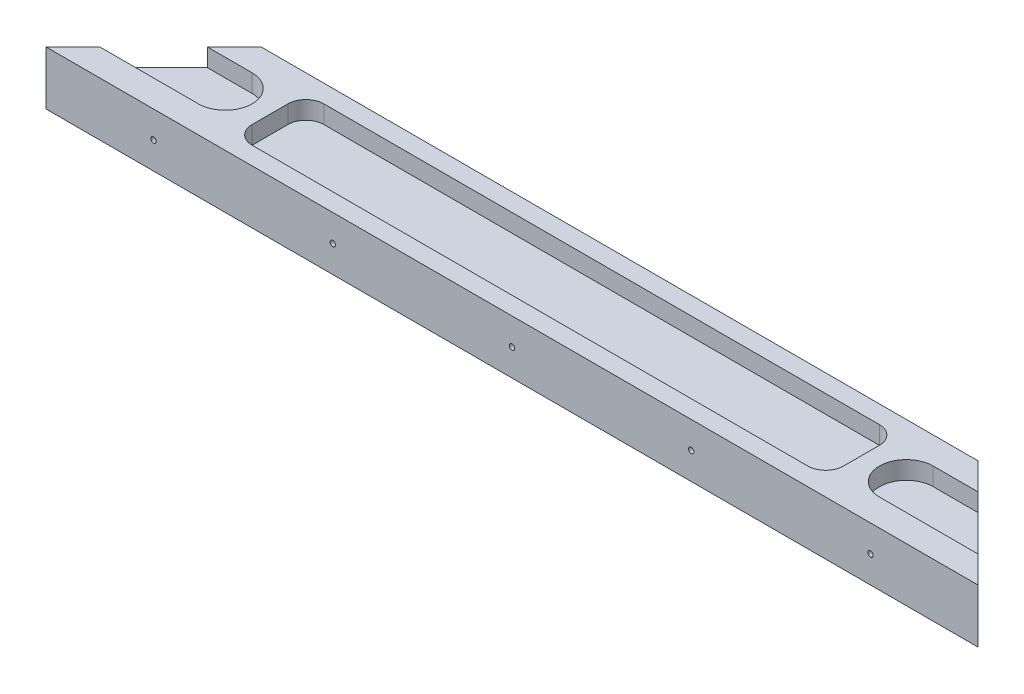
ISO-10303-21;
HEADER;
FILE_DESCRIPTION(('STEP AP214'),'2;1');
FILE_NAME('part.step','',(''),(''),'','','');
FILE_SCHEMA(('AUTOMOTIVE_DESIGN { 1 0 10303 214 1 1 1 1 }'));
ENDSEC;
DATA;
#1=APPLICATION_CONTEXT('core data for automotive mechanical design processes');
#2=APPLICATION_PROTOCOL_DEFINITION('international standard','automotive_design',2000,#1);
#3=PRODUCT_CONTEXT('',#1,'mechanical');
#4=PRODUCT('Part','Part','',(#3));
#5=PRODUCT_RELATED_PRODUCT_CATEGORY('part','',(#4));
#6=PRODUCT_DEFINITION_FORMATION('','',#4);
#7=PRODUCT_DEFINITION_CONTEXT('part definition',#1,'design');
#8=PRODUCT_DEFINITION('design','',#6,#7);
#9=PRODUCT_DEFINITION_SHAPE('','',#8);
#10=(LENGTH_UNIT() NAMED_UNIT(*) SI_UNIT(.MILLI.,.METRE.));
#11=(NAMED_UNIT(*) PLANE_ANGLE_UNIT() SI_UNIT($,.RADIAN.));
#12=(NAMED_UNIT(*) SI_UNIT($,.STERADIAN.) SOLID_ANGLE_UNIT());
#13=UNCERTAINTY_MEASURE_WITH_UNIT(LENGTH_MEASURE(1.E-05),#10,'distance_accuracy_value','');
#14=(GEOMETRIC_REPRESENTATION_CONTEXT(3) GLOBAL_UNCERTAINTY_ASSIGNED_CONTEXT((#13)) GLOBAL_UNIT_ASSIGNED_CONTEXT((#10,
#11,#12)) REPRESENTATION_CONTEXT('',''));
#15=CARTESIAN_POINT('',(0.,0.,0.));
#16=DIRECTION('',(0.,0.,1.));
#17=DIRECTION('',(1.,0.,0.));
#18=AXIS2_PLACEMENT_3D('',#15,#16,#17);
#19=CARTESIAN_POINT('',(30.,15.,-30.));
#20=DIRECTION('',(0.707106781186547,0.,0.707106781186548));
#21=DIRECTION('',(0.707106781186548,0.,-0.707106781186547));
#22=AXIS2_PLACEMENT_3D('',#19,#20,#21);
#23=PLANE('',#22);
#24=DIRECTION('',(0.,-1.,0.));
#25=VECTOR('',#24,1.);
#26=CARTESIAN_POINT('',(30.,15.,-30.));
#27=LINE('',#26,#25);
#28=CARTESIAN_POINT('',(30.,15.,-30.));
#29=VERTEX_POINT('',#28);
#30=CARTESIAN_POINT('',(30.,8.24999999999931,-30.));
#31=VERTEX_POINT('',#30);
#32=EDGE_CURVE('E360',#29,#31,#27,.T.);
#33=ORIENTED_EDGE('',*,*,#32,.T.);
#34=CARTESIAN_POINT('',(30.,7.4999999999993,-30.));
#35=DIRECTION('',(0.707106781186547,0.,0.707106781186548));
#36=DIRECTION('',(-0.707106781186548,0.,0.707106781186547));
#37=AXIS2_PLACEMENT_3D('',#34,#35,#36);
#38=ELLIPSE('',#37,1.06066017177984,0.750000000000012);
#39=CARTESIAN_POINT('',(30.,6.74999999999929,-30.));
#40=VERTEX_POINT('',#39);
#41=EDGE_CURVE('E285',#31,#40,#38,.T.);
#42=ORIENTED_EDGE('',*,*,#41,.T.);
#43=CARTESIAN_POINT('',(30.,0.,-30.));
#44=VERTEX_POINT('',#43);
#45=EDGE_CURVE('E349',#40,#44,#27,.T.);
#46=ORIENTED_EDGE('',*,*,#45,.T.);
#47=DIRECTION('',(-0.707106781186548,0.,0.707106781186547));
#48=VECTOR('',#47,1.);
#49=CARTESIAN_POINT('',(30.,0.,-30.));
#50=LINE('',#49,#48);
#51=CARTESIAN_POINT('',(0.,0.,0.));
#52=VERTEX_POINT('',#51);
#53=EDGE_CURVE('E336',#44,#52,#50,.T.);
#54=ORIENTED_EDGE('',*,*,#53,.T.);
#55=DIRECTION('',(0.,-1.,0.));
#56=VECTOR('',#55,1.);
#57=CARTESIAN_POINT('',(0.,15.,0.));
#58=LINE('',#57,#56);
#59=CARTESIAN_POINT('',(0.,15.,0.));
#60=VERTEX_POINT('',#59);
#61=EDGE_CURVE('E370',#60,#52,#58,.T.);
#62=ORIENTED_EDGE('',*,*,#61,.F.);
#63=DIRECTION('',(-0.707106781186548,0.,0.707106781186547));
#64=VECTOR('',#63,1.);
#65=CARTESIAN_POINT('',(30.,15.,-30.));
#66=LINE('',#65,#64);
#67=CARTESIAN_POINT('',(7.49999999999999,15.,-7.49999999999998));
#68=VERTEX_POINT('',#67);
#69=EDGE_CURVE('E341',#68,#60,#66,.T.);
#70=ORIENTED_EDGE('',*,*,#69,.F.);
#71=DIRECTION('',(0.,-1.,0.));
#72=VECTOR('',#71,1.);
#73=CARTESIAN_POINT('',(7.5,15.,-7.49999999999999));
#74=LINE('',#73,#72);
#75=CARTESIAN_POINT('',(7.49999999999998,10.,-7.49999999999998));
#76=VERTEX_POINT('',#75);
#77=EDGE_CURVE('E330',#68,#76,#74,.T.);
#78=ORIENTED_EDGE('',*,*,#77,.T.);
#79=DIRECTION('',(-0.707106781186548,0.,0.707106781186547));
#80=VECTOR('',#79,1.);
#81=CARTESIAN_POINT('',(30.,10.,-30.));
#82=LINE('',#81,#80);
#83=CARTESIAN_POINT('',(22.5,10.,-22.5));
#84=VERTEX_POINT('',#83);
#85=EDGE_CURVE('E47',#84,#76,#82,.T.);
#86=ORIENTED_EDGE('',*,*,#85,.F.);
#87=DIRECTION('',(0.,1.,0.));
#88=VECTOR('',#87,1.);
#89=CARTESIAN_POINT('',(22.5,15.,-22.5));
#90=LINE('',#89,#88);
#91=CARTESIAN_POINT('',(22.5,15.,-22.5));
#92=VERTEX_POINT('',#91);
#93=EDGE_CURVE('E333',#84,#92,#90,.T.);
#94=ORIENTED_EDGE('',*,*,#93,.T.);
#95=EDGE_CURVE('E337',#29,#92,#66,.T.);
#96=ORIENTED_EDGE('',*,*,#95,.F.);
#97=EDGE_LOOP('',(#33,#42,#46,#54,#62,#70,#78,#86,#94,#96));
#98=FACE_BOUND('',#97,.T.);
#99=ADVANCED_FACE('F40',(#98),#23,.F.);
#100=CARTESIAN_POINT('',(0.,15.,0.));
#101=DIRECTION('',(0.,0.,-1.));
#102=DIRECTION('',(-1.,0.,0.));
#103=AXIS2_PLACEMENT_3D('',#100,#101,#102);
#104=PLANE('',#103);
#105=CARTESIAN_POINT('',(30.,7.4999999999993,0.));
#106=DIRECTION('',(0.,0.,1.));
#107=DIRECTION('',(1.,0.,0.));
#108=AXIS2_PLACEMENT_3D('',#105,#106,#107);
#109=CIRCLE('',#108,0.750000000000012);
#110=CARTESIAN_POINT('',(30.75,7.4999999999993,0.));
#111=VERTEX_POINT('',#110);
#112=EDGE_CURVE('E247',#111,#111,#109,.T.);
#113=ORIENTED_EDGE('',*,*,#112,.F.);
#114=EDGE_LOOP('',(#113));
#115=FACE_BOUND('',#114,.T.);
#116=CARTESIAN_POINT('',(80.,7.49999999999965,0.));
#117=DIRECTION('',(0.,0.,1.));
#118=DIRECTION('',(1.,0.,0.));
#119=AXIS2_PLACEMENT_3D('',#116,#117,#118);
#120=CIRCLE('',#119,0.750000000000012);
#121=CARTESIAN_POINT('',(80.75,7.49999999999965,0.));
#122=VERTEX_POINT('',#121);
#123=EDGE_CURVE('E269',#122,#122,#120,.T.);
#124=ORIENTED_EDGE('',*,*,#123,.F.);
#125=EDGE_LOOP('',(#124));
#126=FACE_BOUND('',#125,.T.);
#127=CARTESIAN_POINT('',(230.,7.5,0.));
#128=DIRECTION('',(0.,0.,1.));
#129=DIRECTION('',(1.,0.,0.));
#130=AXIS2_PLACEMENT_3D('',#127,#128,#129);
#131=CIRCLE('',#130,0.750000000000012);
#132=CARTESIAN_POINT('',(230.75,7.5,0.));
#133=VERTEX_POINT('',#132);
#134=EDGE_CURVE('E263',#133,#133,#131,.T.);
#135=ORIENTED_EDGE('',*,*,#134,.F.);
#136=EDGE_LOOP('',(#135));
#137=FACE_BOUND('',#136,.T.);
#138=CARTESIAN_POINT('',(180.,7.5,0.));
#139=DIRECTION('',(0.,0.,1.));
#140=DIRECTION('',(1.,0.,0.));
#141=AXIS2_PLACEMENT_3D('',#138,#139,#140);
#142=CIRCLE('',#141,0.750000000000039);
#143=CARTESIAN_POINT('',(180.75,7.5,0.));
#144=VERTEX_POINT('',#143);
#145=EDGE_CURVE('E262',#144,#144,#142,.T.);
#146=ORIENTED_EDGE('',*,*,#145,.F.);
#147=EDGE_LOOP('',(#146));
#148=FACE_BOUND('',#147,.T.);
#149=CARTESIAN_POINT('',(130.,7.5,0.));
#150=DIRECTION('',(0.,0.,1.));
#151=DIRECTION('',(1.,0.,0.));
#152=AXIS2_PLACEMENT_3D('',#149,#150,#151);
#153=CIRCLE('',#152,0.750000000000012);
#154=CARTESIAN_POINT('',(130.75,7.5,0.));
#155=VERTEX_POINT('',#154);
#156=EDGE_CURVE('E266',#155,#155,#153,.T.);
#157=ORIENTED_EDGE('',*,*,#156,.F.);
#158=EDGE_LOOP('',(#157));
#159=FACE_BOUND('',#158,.T.);
#160=DIRECTION('',(1.,0.,0.));
#161=VECTOR('',#160,1.);
#162=CARTESIAN_POINT('',(0.,0.,0.));
#163=LINE('',#162,#161);
#164=CARTESIAN_POINT('',(260.,0.,0.));
#165=VERTEX_POINT('',#164);
#166=EDGE_CURVE('E352',#52,#165,#163,.T.);
#167=ORIENTED_EDGE('',*,*,#166,.T.);
#168=DIRECTION('',(0.,-1.,0.));
#169=VECTOR('',#168,1.);
#170=CARTESIAN_POINT('',(260.,15.,0.));
#171=LINE('',#170,#169);
#172=CARTESIAN_POINT('',(260.,15.,0.));
#173=VERTEX_POINT('',#172);
#174=EDGE_CURVE('E367',#173,#165,#171,.T.);
#175=ORIENTED_EDGE('',*,*,#174,.F.);
#176=DIRECTION('',(1.,0.,0.));
#177=VECTOR('',#176,1.);
#178=CARTESIAN_POINT('',(0.,15.,0.));
#179=LINE('',#178,#177);
#180=EDGE_CURVE('E340',#60,#173,#179,.T.);
#181=ORIENTED_EDGE('',*,*,#180,.F.);
#182=ORIENTED_EDGE('',*,*,#61,.T.);
#183=EDGE_LOOP('',(#167,#175,#181,#182));
#184=FACE_BOUND('',#183,.T.);
#185=ADVANCED_FACE('F399',(#115,#126,#137,#148,#159,#184),#104,.F.);
#186=CARTESIAN_POINT('',(260.,15.,0.));
#187=DIRECTION('',(-0.707106781186547,0.,0.707106781186548));
#188=DIRECTION('',(0.707106781186548,0.,0.707106781186547));
#189=AXIS2_PLACEMENT_3D('',#186,#187,#188);
#190=PLANE('',#189);
#191=DIRECTION('',(0.,-1.,0.));
#192=VECTOR('',#191,1.);
#193=CARTESIAN_POINT('',(230.,15.,-30.));
#194=LINE('',#193,#192);
#195=CARTESIAN_POINT('',(230.,6.74999999999999,-30.));
#196=VERTEX_POINT('',#195);
#197=CARTESIAN_POINT('',(230.,0.,-30.));
#198=VERTEX_POINT('',#197);
#199=EDGE_CURVE('E363',#196,#198,#194,.T.);
#200=ORIENTED_EDGE('',*,*,#199,.F.);
#201=CARTESIAN_POINT('',(230.,7.5,-30.));
#202=DIRECTION('',(-0.707106781186547,0.,0.707106781186548));
#203=DIRECTION('',(0.707106781186548,0.,0.707106781186547));
#204=AXIS2_PLACEMENT_3D('',#201,#202,#203);
#205=ELLIPSE('',#204,1.06066017177984,0.750000000000012);
#206=CARTESIAN_POINT('',(230.,8.25000000000001,-30.));
#207=VERTEX_POINT('',#206);
#208=EDGE_CURVE('E61',#196,#207,#205,.T.);
#209=ORIENTED_EDGE('',*,*,#208,.T.);
#210=CARTESIAN_POINT('',(230.,15.,-30.));
#211=VERTEX_POINT('',#210);
#212=EDGE_CURVE('E364',#211,#207,#194,.T.);
#213=ORIENTED_EDGE('',*,*,#212,.F.);
#214=DIRECTION('',(-0.707106781186548,0.,-0.707106781186547));
#215=VECTOR('',#214,1.);
#216=CARTESIAN_POINT('',(260.,15.,0.));
#217=LINE('',#216,#215);
#218=CARTESIAN_POINT('',(237.5,15.,-22.5));
#219=VERTEX_POINT('',#218);
#220=EDGE_CURVE('E343',#219,#211,#217,.T.);
#221=ORIENTED_EDGE('',*,*,#220,.F.);
#222=DIRECTION('',(0.,-1.,0.));
#223=VECTOR('',#222,1.);
#224=CARTESIAN_POINT('',(237.5,15.,-22.5));
#225=LINE('',#224,#223);
#226=CARTESIAN_POINT('',(237.5,10.,-22.5));
#227=VERTEX_POINT('',#226);
#228=EDGE_CURVE('E306',#219,#227,#225,.T.);
#229=ORIENTED_EDGE('',*,*,#228,.T.);
#230=DIRECTION('',(0.707106781186548,0.,0.707106781186547));
#231=VECTOR('',#230,1.);
#232=CARTESIAN_POINT('',(260.,10.,0.));
#233=LINE('',#232,#231);
#234=CARTESIAN_POINT('',(252.5,10.,-7.49999999999999));
#235=VERTEX_POINT('',#234);
#236=EDGE_CURVE('E379',#227,#235,#233,.T.);
#237=ORIENTED_EDGE('',*,*,#236,.T.);
#238=DIRECTION('',(0.,1.,0.));
#239=VECTOR('',#238,1.);
#240=CARTESIAN_POINT('',(252.5,15.,-7.49999999999998));
#241=LINE('',#240,#239);
#242=CARTESIAN_POINT('',(252.5,15.,-7.49999999999998));
#243=VERTEX_POINT('',#242);
#244=EDGE_CURVE('E327',#235,#243,#241,.T.);
#245=ORIENTED_EDGE('',*,*,#244,.T.);
#246=EDGE_CURVE('E344',#173,#243,#217,.T.);
#247=ORIENTED_EDGE('',*,*,#246,.F.);
#248=ORIENTED_EDGE('',*,*,#174,.T.);
#249=DIRECTION('',(-0.707106781186548,0.,-0.707106781186547));
#250=VECTOR('',#249,1.);
#251=CARTESIAN_POINT('',(260.,0.,0.));
#252=LINE('',#251,#250);
#253=EDGE_CURVE('E354',#165,#198,#252,.T.);
#254=ORIENTED_EDGE('',*,*,#253,.T.);
#255=EDGE_LOOP('',(#200,#209,#213,#221,#229,#237,#245,#247,#248,#254));
#256=FACE_BOUND('',#255,.T.);
#257=ADVANCED_FACE('F404',(#256),#190,.F.);
#258=CARTESIAN_POINT('',(230.,15.,-30.));
#259=DIRECTION('',(0.,0.,1.));
#260=DIRECTION('',(1.,0.,0.));
#261=AXIS2_PLACEMENT_3D('',#258,#259,#260);
#262=PLANE('',#261);
#263=CARTESIAN_POINT('',(80.,7.49999999999965,-30.));
#264=DIRECTION('',(0.,0.,1.));
#265=DIRECTION('',(1.,0.,0.));
#266=AXIS2_PLACEMENT_3D('',#263,#264,#265);
#267=CIRCLE('',#266,0.750000000000012);
#268=CARTESIAN_POINT('',(80.75,7.49999999999965,-30.));
#269=VERTEX_POINT('',#268);
#270=EDGE_CURVE('E272',#269,#269,#267,.F.);
#271=ORIENTED_EDGE('',*,*,#270,.F.);
#272=EDGE_LOOP('',(#271));
#273=FACE_BOUND('',#272,.T.);
#274=CARTESIAN_POINT('',(180.,7.5,-30.));
#275=DIRECTION('',(0.,0.,1.));
#276=DIRECTION('',(1.,0.,0.));
#277=AXIS2_PLACEMENT_3D('',#274,#275,#276);
#278=CIRCLE('',#277,0.750000000000039);
#279=CARTESIAN_POINT('',(180.75,7.5,-30.));
#280=VERTEX_POINT('',#279);
#281=EDGE_CURVE('E259',#280,#280,#278,.F.);
#282=ORIENTED_EDGE('',*,*,#281,.F.);
#283=EDGE_LOOP('',(#282));
#284=FACE_BOUND('',#283,.T.);
#285=CARTESIAN_POINT('',(130.,7.5,-30.));
#286=DIRECTION('',(0.,0.,1.));
#287=DIRECTION('',(1.,0.,0.));
#288=AXIS2_PLACEMENT_3D('',#285,#286,#287);
#289=CIRCLE('',#288,0.750000000000012);
#290=CARTESIAN_POINT('',(130.75,7.5,-30.));
#291=VERTEX_POINT('',#290);
#292=EDGE_CURVE('E281',#291,#291,#289,.F.);
#293=ORIENTED_EDGE('',*,*,#292,.F.);
#294=EDGE_LOOP('',(#293));
#295=FACE_BOUND('',#294,.T.);
#296=ORIENTED_EDGE('',*,*,#45,.F.);
#297=CARTESIAN_POINT('',(30.,7.4999999999993,-30.));
#298=DIRECTION('',(0.,0.,1.));
#299=DIRECTION('',(1.,0.,0.));
#300=AXIS2_PLACEMENT_3D('',#297,#298,#299);
#301=CIRCLE('',#300,0.750000000000012);
#302=EDGE_CURVE('E11',#40,#31,#301,.T.);
#303=ORIENTED_EDGE('',*,*,#302,.T.);
#304=ORIENTED_EDGE('',*,*,#32,.F.);
#305=DIRECTION('',(-1.,0.,0.));
#306=VECTOR('',#305,1.);
#307=CARTESIAN_POINT('',(230.,15.,-30.));
#308=LINE('',#307,#306);
#309=EDGE_CURVE('E347',#211,#29,#308,.T.);
#310=ORIENTED_EDGE('',*,*,#309,.F.);
#311=ORIENTED_EDGE('',*,*,#212,.T.);
#312=CARTESIAN_POINT('',(230.,7.5,-30.));
#313=DIRECTION('',(0.,0.,1.));
#314=DIRECTION('',(1.,0.,0.));
#315=AXIS2_PLACEMENT_3D('',#312,#313,#314);
#316=CIRCLE('',#315,0.750000000000012);
#317=EDGE_CURVE('E267',#196,#207,#316,.F.);
#318=ORIENTED_EDGE('',*,*,#317,.F.);
#319=ORIENTED_EDGE('',*,*,#199,.T.);
#320=DIRECTION('',(-1.,0.,0.));
#321=VECTOR('',#320,1.);
#322=CARTESIAN_POINT('',(230.,0.,-30.));
#323=LINE('',#322,#321);
#324=EDGE_CURVE('E357',#198,#44,#323,.T.);
#325=ORIENTED_EDGE('',*,*,#324,.T.);
#326=EDGE_LOOP('',(#296,#303,#304,#310,#311,#318,#319,#325));
#327=FACE_BOUND('',#326,.T.);
#328=ADVANCED_FACE('F423',(#273,#284,#295,#327),#262,.F.);
#329=CARTESIAN_POINT('',(0.,15.,0.));
#330=DIRECTION('',(0.,-1.,0.));
#331=DIRECTION('',(0.,0.,-1.));
#332=AXIS2_PLACEMENT_3D('',#329,#330,#331);
#333=PLANE('',#332);
#334=DIRECTION('',(0.,0.,1.));
#335=VECTOR('',#334,1.);
#336=CARTESIAN_POINT('',(47.5,15.,-19.9999999999999));
#337=LINE('',#336,#335);
#338=CARTESIAN_POINT('',(47.5,15.,-19.9999999999999));
#339=VERTEX_POINT('',#338);
#340=CARTESIAN_POINT('',(47.5,15.,-10.));
#341=VERTEX_POINT('',#340);
#342=EDGE_CURVE('E229',#339,#341,#337,.T.);
#343=ORIENTED_EDGE('',*,*,#342,.F.);
#344=CARTESIAN_POINT('',(52.5,15.,-20.));
#345=DIRECTION('',(0.,1.,0.));
#346=DIRECTION('',(0.,0.,1.));
#347=AXIS2_PLACEMENT_3D('',#344,#345,#346);
#348=CIRCLE('',#347,5.);
#349=CARTESIAN_POINT('',(52.5,15.,-25.));
#350=VERTEX_POINT('',#349);
#351=EDGE_CURVE('E54',#350,#339,#348,.T.);
#352=ORIENTED_EDGE('',*,*,#351,.F.);
#353=DIRECTION('',(-1.,0.,0.));
#354=VECTOR('',#353,1.);
#355=CARTESIAN_POINT('',(52.5,15.,-25.));
#356=LINE('',#355,#354);
#357=CARTESIAN_POINT('',(207.5,15.,-25.));
#358=VERTEX_POINT('',#357);
#359=EDGE_CURVE('E209',#358,#350,#356,.T.);
#360=ORIENTED_EDGE('',*,*,#359,.F.);
#361=CARTESIAN_POINT('',(207.5,15.,-20.));
#362=DIRECTION('',(0.,1.,0.));
#363=DIRECTION('',(0.,0.,-1.));
#364=AXIS2_PLACEMENT_3D('',#361,#362,#363);
#365=CIRCLE('',#364,5.);
#366=CARTESIAN_POINT('',(212.5,15.,-19.9999999999999));
#367=VERTEX_POINT('',#366);
#368=EDGE_CURVE('E212',#367,#358,#365,.T.);
#369=ORIENTED_EDGE('',*,*,#368,.F.);
#370=DIRECTION('',(0.,0.,-1.));
#371=VECTOR('',#370,1.);
#372=CARTESIAN_POINT('',(212.5,15.,-19.9999999999999));
#373=LINE('',#372,#371);
#374=CARTESIAN_POINT('',(212.5,15.,-10.));
#375=VERTEX_POINT('',#374);
#376=EDGE_CURVE('E240',#375,#367,#373,.T.);
#377=ORIENTED_EDGE('',*,*,#376,.F.);
#378=CARTESIAN_POINT('',(207.5,15.,-10.));
#379=DIRECTION('',(0.,1.,0.));
#380=DIRECTION('',(0.,0.,1.));
#381=AXIS2_PLACEMENT_3D('',#378,#379,#380);
#382=CIRCLE('',#381,5.);
#383=CARTESIAN_POINT('',(207.5,15.,-5.));
#384=VERTEX_POINT('',#383);
#385=EDGE_CURVE('E237',#384,#375,#382,.T.);
#386=ORIENTED_EDGE('',*,*,#385,.F.);
#387=DIRECTION('',(1.,0.,0.));
#388=VECTOR('',#387,1.);
#389=CARTESIAN_POINT('',(52.5,15.,-5.));
#390=LINE('',#389,#388);
#391=CARTESIAN_POINT('',(52.5,15.,-5.));
#392=VERTEX_POINT('',#391);
#393=EDGE_CURVE('E234',#392,#384,#390,.T.);
#394=ORIENTED_EDGE('',*,*,#393,.F.);
#395=CARTESIAN_POINT('',(52.5,15.,-10.));
#396=DIRECTION('',(0.,1.,0.));
#397=DIRECTION('',(0.,0.,1.));
#398=AXIS2_PLACEMENT_3D('',#395,#396,#397);
#399=CIRCLE('',#398,5.);
#400=EDGE_CURVE('E231',#341,#392,#399,.T.);
#401=ORIENTED_EDGE('',*,*,#400,.F.);
#402=EDGE_LOOP('',(#343,#352,#360,#369,#377,#386,#394,#401));
#403=FACE_BOUND('',#402,.T.);
#404=ORIENTED_EDGE('',*,*,#95,.T.);
#405=DIRECTION('',(-1.,0.,0.));
#406=VECTOR('',#405,1.);
#407=CARTESIAN_POINT('',(-5.,15.,-22.5));
#408=LINE('',#407,#406);
#409=CARTESIAN_POINT('',(35.,15.,-22.5));
#410=VERTEX_POINT('',#409);
#411=EDGE_CURVE('E292',#410,#92,#408,.T.);
#412=ORIENTED_EDGE('',*,*,#411,.F.);
#413=CARTESIAN_POINT('',(35.,15.,-15.));
#414=DIRECTION('',(0.,1.,0.));
#415=DIRECTION('',(0.,0.,1.));
#416=AXIS2_PLACEMENT_3D('',#413,#414,#415);
#417=CIRCLE('',#416,7.5);
#418=CARTESIAN_POINT('',(35.,15.,-7.49999999999999));
#419=VERTEX_POINT('',#418);
#420=EDGE_CURVE('E299',#419,#410,#417,.T.);
#421=ORIENTED_EDGE('',*,*,#420,.F.);
#422=DIRECTION('',(-1.,0.,0.));
#423=VECTOR('',#422,1.);
#424=CARTESIAN_POINT('',(0.,15.,-7.49999999999998));
#425=LINE('',#424,#423);
#426=EDGE_CURVE('E376',#419,#68,#425,.T.);
#427=ORIENTED_EDGE('',*,*,#426,.T.);
#428=ORIENTED_EDGE('',*,*,#69,.T.);
#429=ORIENTED_EDGE('',*,*,#180,.T.);
#430=ORIENTED_EDGE('',*,*,#246,.T.);
#431=DIRECTION('',(1.,0.,0.));
#432=VECTOR('',#431,1.);
#433=CARTESIAN_POINT('',(265.,15.,-7.49999999999998));
#434=LINE('',#433,#432);
#435=CARTESIAN_POINT('',(225.,15.,-7.49999999999999));
#436=VERTEX_POINT('',#435);
#437=EDGE_CURVE('E314',#436,#243,#434,.T.);
#438=ORIENTED_EDGE('',*,*,#437,.F.);
#439=CARTESIAN_POINT('',(225.,15.,-15.));
#440=DIRECTION('',(0.,1.,0.));
#441=DIRECTION('',(0.,0.,-1.));
#442=AXIS2_PLACEMENT_3D('',#439,#440,#441);
#443=CIRCLE('',#442,7.5);
#444=CARTESIAN_POINT('',(225.,15.,-22.5));
#445=VERTEX_POINT('',#444);
#446=EDGE_CURVE('E302',#445,#436,#443,.T.);
#447=ORIENTED_EDGE('',*,*,#446,.F.);
#448=DIRECTION('',(1.,0.,0.));
#449=VECTOR('',#448,1.);
#450=CARTESIAN_POINT('',(0.,15.,-22.5));
#451=LINE('',#450,#449);
#452=EDGE_CURVE('E373',#445,#219,#451,.T.);
#453=ORIENTED_EDGE('',*,*,#452,.T.);
#454=ORIENTED_EDGE('',*,*,#220,.T.);
#455=ORIENTED_EDGE('',*,*,#309,.T.);
#456=EDGE_LOOP('',(#404,#412,#421,#427,#428,#429,#430,#438,#447,#453,#454,#455));
#457=FACE_BOUND('',#456,.T.);
#458=ADVANCED_FACE('F395',(#403,#457),#333,.F.);
#459=CARTESIAN_POINT('',(0.,0.,0.));
#460=DIRECTION('',(0.,-1.,0.));
#461=DIRECTION('',(0.,0.,-1.));
#462=AXIS2_PLACEMENT_3D('',#459,#460,#461);
#463=PLANE('',#462);
#464=ORIENTED_EDGE('',*,*,#53,.F.);
#465=ORIENTED_EDGE('',*,*,#324,.F.);
#466=ORIENTED_EDGE('',*,*,#253,.F.);
#467=ORIENTED_EDGE('',*,*,#166,.F.);
#468=EDGE_LOOP('',(#464,#465,#466,#467));
#469=FACE_BOUND('',#468,.T.);
#470=ADVANCED_FACE('F457',(#469),#463,.T.);
#471=CARTESIAN_POINT('',(265.,10.,-15.));
#472=DIRECTION('',(0.,-1.,0.));
#473=DIRECTION('',(0.,0.,-1.));
#474=AXIS2_PLACEMENT_3D('',#471,#472,#473);
#475=PLANE('',#474);
#476=DIRECTION('',(-1.,0.,0.));
#477=VECTOR('',#476,1.);
#478=CARTESIAN_POINT('',(265.,10.,-22.5));
#479=LINE('',#478,#477);
#480=CARTESIAN_POINT('',(225.,10.,-22.5));
#481=VERTEX_POINT('',#480);
#482=EDGE_CURVE('E316',#227,#481,#479,.T.);
#483=ORIENTED_EDGE('',*,*,#482,.T.);
#484=CARTESIAN_POINT('',(225.,10.,-15.));
#485=DIRECTION('',(0.,1.,0.));
#486=DIRECTION('',(0.,0.,-1.));
#487=AXIS2_PLACEMENT_3D('',#484,#485,#486);
#488=CIRCLE('',#487,7.5);
#489=CARTESIAN_POINT('',(225.,10.,-7.49999999999999));
#490=VERTEX_POINT('',#489);
#491=EDGE_CURVE('E321',#481,#490,#488,.T.);
#492=ORIENTED_EDGE('',*,*,#491,.T.);
#493=DIRECTION('',(1.,0.,0.));
#494=VECTOR('',#493,1.);
#495=CARTESIAN_POINT('',(265.,10.,-7.49999999999998));
#496=LINE('',#495,#494);
#497=EDGE_CURVE('E312',#490,#235,#496,.T.);
#498=ORIENTED_EDGE('',*,*,#497,.T.);
#499=ORIENTED_EDGE('',*,*,#236,.F.);
#500=EDGE_LOOP('',(#483,#492,#498,#499));
#501=FACE_BOUND('',#500,.T.);
#502=ADVANCED_FACE('F460',(#501),#475,.F.);
#503=CARTESIAN_POINT('',(265.,10.,-7.49999999999998));
#504=DIRECTION('',(0.,0.,1.));
#505=DIRECTION('',(1.,0.,0.));
#506=AXIS2_PLACEMENT_3D('',#503,#504,#505);
#507=PLANE('',#506);
#508=ORIENTED_EDGE('',*,*,#497,.F.);
#509=DIRECTION('',(0.,1.,0.));
#510=VECTOR('',#509,1.);
#511=CARTESIAN_POINT('',(225.,10.,-7.49999999999999));
#512=LINE('',#511,#510);
#513=EDGE_CURVE('E288',#490,#436,#512,.T.);
#514=ORIENTED_EDGE('',*,*,#513,.T.);
#515=ORIENTED_EDGE('',*,*,#437,.T.);
#516=ORIENTED_EDGE('',*,*,#244,.F.);
#517=EDGE_LOOP('',(#508,#514,#515,#516));
#518=FACE_BOUND('',#517,.T.);
#519=ADVANCED_FACE('F409',(#518),#507,.F.);
#520=CARTESIAN_POINT('',(265.,10.,-22.5));
#521=DIRECTION('',(0.,0.,-1.));
#522=DIRECTION('',(-1.,0.,0.));
#523=AXIS2_PLACEMENT_3D('',#520,#521,#522);
#524=PLANE('',#523);
#525=ORIENTED_EDGE('',*,*,#452,.F.);
#526=DIRECTION('',(0.,1.,0.));
#527=VECTOR('',#526,1.);
#528=CARTESIAN_POINT('',(225.,10.,-22.5));
#529=LINE('',#528,#527);
#530=EDGE_CURVE('E309',#481,#445,#529,.T.);
#531=ORIENTED_EDGE('',*,*,#530,.F.);
#532=ORIENTED_EDGE('',*,*,#482,.F.);
#533=ORIENTED_EDGE('',*,*,#228,.F.);
#534=EDGE_LOOP('',(#525,#531,#532,#533));
#535=FACE_BOUND('',#534,.T.);
#536=ADVANCED_FACE('F416',(#535),#524,.F.);
#537=CARTESIAN_POINT('',(225.,10.,-15.));
#538=DIRECTION('',(0.,1.,0.));
#539=DIRECTION('',(0.,0.,1.));
#540=AXIS2_PLACEMENT_3D('',#537,#538,#539);
#541=CYLINDRICAL_SURFACE('',#540,7.5);
#542=ORIENTED_EDGE('',*,*,#446,.T.);
#543=ORIENTED_EDGE('',*,*,#513,.F.);
#544=ORIENTED_EDGE('',*,*,#491,.F.);
#545=ORIENTED_EDGE('',*,*,#530,.T.);
#546=EDGE_LOOP('',(#542,#543,#544,#545));
#547=FACE_BOUND('',#546,.T.);
#548=ADVANCED_FACE('F412',(#547),#541,.F.);
#549=CARTESIAN_POINT('',(-5.,10.,-15.));
#550=DIRECTION('',(0.,1.,0.));
#551=DIRECTION('',(0.,0.,1.));
#552=AXIS2_PLACEMENT_3D('',#549,#550,#551);
#553=PLANE('',#552);
#554=ORIENTED_EDGE('',*,*,#85,.T.);
#555=DIRECTION('',(1.,0.,0.));
#556=VECTOR('',#555,1.);
#557=CARTESIAN_POINT('',(-5.,10.,-7.49999999999998));
#558=LINE('',#557,#556);
#559=CARTESIAN_POINT('',(35.,10.,-7.49999999999999));
#560=VERTEX_POINT('',#559);
#561=EDGE_CURVE('E289',#76,#560,#558,.T.);
#562=ORIENTED_EDGE('',*,*,#561,.T.);
#563=CARTESIAN_POINT('',(35.,10.,-15.));
#564=DIRECTION('',(0.,1.,0.));
#565=DIRECTION('',(0.,0.,1.));
#566=AXIS2_PLACEMENT_3D('',#563,#564,#565);
#567=CIRCLE('',#566,7.5);
#568=CARTESIAN_POINT('',(35.,10.,-22.5));
#569=VERTEX_POINT('',#568);
#570=EDGE_CURVE('E291',#560,#569,#567,.T.);
#571=ORIENTED_EDGE('',*,*,#570,.T.);
#572=DIRECTION('',(-1.,0.,0.));
#573=VECTOR('',#572,1.);
#574=CARTESIAN_POINT('',(-5.,10.,-22.5));
#575=LINE('',#574,#573);
#576=EDGE_CURVE('E295',#569,#84,#575,.T.);
#577=ORIENTED_EDGE('',*,*,#576,.T.);
#578=EDGE_LOOP('',(#554,#562,#571,#577));
#579=FACE_BOUND('',#578,.T.);
#580=ADVANCED_FACE('F384',(#579),#553,.T.);
#581=CARTESIAN_POINT('',(-5.,10.,-22.5));
#582=DIRECTION('',(0.,0.,-1.));
#583=DIRECTION('',(-1.,0.,0.));
#584=AXIS2_PLACEMENT_3D('',#581,#582,#583);
#585=PLANE('',#584);
#586=ORIENTED_EDGE('',*,*,#576,.F.);
#587=DIRECTION('',(0.,1.,0.));
#588=VECTOR('',#587,1.);
#589=CARTESIAN_POINT('',(35.,10.,-22.5));
#590=LINE('',#589,#588);
#591=EDGE_CURVE('E304',#569,#410,#590,.T.);
#592=ORIENTED_EDGE('',*,*,#591,.T.);
#593=ORIENTED_EDGE('',*,*,#411,.T.);
#594=ORIENTED_EDGE('',*,*,#93,.F.);
#595=EDGE_LOOP('',(#586,#592,#593,#594));
#596=FACE_BOUND('',#595,.T.);
#597=ADVANCED_FACE('F427',(#596),#585,.F.);
#598=CARTESIAN_POINT('',(-5.,10.,-7.49999999999998));
#599=DIRECTION('',(0.,0.,1.));
#600=DIRECTION('',(1.,0.,0.));
#601=AXIS2_PLACEMENT_3D('',#598,#599,#600);
#602=PLANE('',#601);
#603=ORIENTED_EDGE('',*,*,#426,.F.);
#604=DIRECTION('',(0.,1.,0.));
#605=VECTOR('',#604,1.);
#606=CARTESIAN_POINT('',(35.,10.,-7.49999999999999));
#607=LINE('',#606,#605);
#608=EDGE_CURVE('E298',#560,#419,#607,.T.);
#609=ORIENTED_EDGE('',*,*,#608,.F.);
#610=ORIENTED_EDGE('',*,*,#561,.F.);
#611=ORIENTED_EDGE('',*,*,#77,.F.);
#612=EDGE_LOOP('',(#603,#609,#610,#611));
#613=FACE_BOUND('',#612,.T.);
#614=ADVANCED_FACE('F389',(#613),#602,.F.);
#615=CARTESIAN_POINT('',(35.,10.,-15.));
#616=DIRECTION('',(0.,1.,0.));
#617=DIRECTION('',(0.,0.,1.));
#618=AXIS2_PLACEMENT_3D('',#615,#616,#617);
#619=CYLINDRICAL_SURFACE('',#618,7.5);
#620=ORIENTED_EDGE('',*,*,#420,.T.);
#621=ORIENTED_EDGE('',*,*,#591,.F.);
#622=ORIENTED_EDGE('',*,*,#570,.F.);
#623=ORIENTED_EDGE('',*,*,#608,.T.);
#624=EDGE_LOOP('',(#620,#621,#622,#623));
#625=FACE_BOUND('',#624,.T.);
#626=ADVANCED_FACE('F429',(#625),#619,.F.);
#627=CARTESIAN_POINT('',(130.,7.5,-32.1213203435597));
#628=DIRECTION('',(0.,0.,1.));
#629=DIRECTION('',(1.,0.,0.));
#630=AXIS2_PLACEMENT_3D('',#627,#628,#629);
#631=CYLINDRICAL_SURFACE('',#630,0.750000000000012);
#632=ORIENTED_EDGE('',*,*,#292,.T.);
#633=EDGE_LOOP('',(#632));
#634=FACE_BOUND('',#633,.T.);
#635=ORIENTED_EDGE('',*,*,#156,.T.);
#636=EDGE_LOOP('',(#635));
#637=FACE_BOUND('',#636,.T.);
#638=ADVANCED_FACE('F431',(#634,#637),#631,.F.);
#639=CARTESIAN_POINT('',(180.,7.5,-32.1213203435597));
#640=DIRECTION('',(0.,0.,1.));
#641=DIRECTION('',(1.,0.,0.));
#642=AXIS2_PLACEMENT_3D('',#639,#640,#641);
#643=CYLINDRICAL_SURFACE('',#642,0.750000000000039);
#644=ORIENTED_EDGE('',*,*,#281,.T.);
#645=EDGE_LOOP('',(#644));
#646=FACE_BOUND('',#645,.T.);
#647=ORIENTED_EDGE('',*,*,#145,.T.);
#648=EDGE_LOOP('',(#647));
#649=FACE_BOUND('',#648,.T.);
#650=ADVANCED_FACE('F438',(#646,#649),#643,.F.);
#651=CARTESIAN_POINT('',(230.,7.5,-32.1213203435597));
#652=DIRECTION('',(0.,0.,1.));
#653=DIRECTION('',(1.,0.,0.));
#654=AXIS2_PLACEMENT_3D('',#651,#652,#653);
#655=CYLINDRICAL_SURFACE('',#654,0.750000000000012);
#656=ORIENTED_EDGE('',*,*,#134,.T.);
#657=EDGE_LOOP('',(#656));
#658=FACE_BOUND('',#657,.T.);
#659=ORIENTED_EDGE('',*,*,#317,.T.);
#660=ORIENTED_EDGE('',*,*,#208,.F.);
#661=EDGE_LOOP('',(#659,#660));
#662=FACE_BOUND('',#661,.T.);
#663=ADVANCED_FACE('F520',(#658,#662),#655,.F.);
#664=CARTESIAN_POINT('',(80.,7.49999999999965,-32.1213203435597));
#665=DIRECTION('',(0.,0.,1.));
#666=DIRECTION('',(1.,0.,0.));
#667=AXIS2_PLACEMENT_3D('',#664,#665,#666);
#668=CYLINDRICAL_SURFACE('',#667,0.750000000000012);
#669=ORIENTED_EDGE('',*,*,#270,.T.);
#670=EDGE_LOOP('',(#669));
#671=FACE_BOUND('',#670,.T.);
#672=ORIENTED_EDGE('',*,*,#123,.T.);
#673=EDGE_LOOP('',(#672));
#674=FACE_BOUND('',#673,.T.);
#675=ADVANCED_FACE('F530',(#671,#674),#668,.F.);
#676=CARTESIAN_POINT('',(30.,7.4999999999993,-32.1213203435597));
#677=DIRECTION('',(0.,0.,1.));
#678=DIRECTION('',(1.,0.,0.));
#679=AXIS2_PLACEMENT_3D('',#676,#677,#678);
#680=CYLINDRICAL_SURFACE('',#679,0.750000000000012);
#681=ORIENTED_EDGE('',*,*,#112,.T.);
#682=EDGE_LOOP('',(#681));
#683=FACE_BOUND('',#682,.T.);
#684=ORIENTED_EDGE('',*,*,#302,.F.);
#685=ORIENTED_EDGE('',*,*,#41,.F.);
#686=EDGE_LOOP('',(#684,#685));
#687=FACE_BOUND('',#686,.T.);
#688=ADVANCED_FACE('F540',(#683,#687),#680,.F.);
#689=CARTESIAN_POINT('',(52.5,10.,-20.));
#690=DIRECTION('',(0.,1.,0.));
#691=DIRECTION('',(0.,0.,1.));
#692=AXIS2_PLACEMENT_3D('',#689,#690,#691);
#693=CYLINDRICAL_SURFACE('',#692,5.);
#694=ORIENTED_EDGE('',*,*,#351,.T.);
#695=DIRECTION('',(0.,1.,0.));
#696=VECTOR('',#695,1.);
#697=CARTESIAN_POINT('',(47.5,10.,-19.9999999999999));
#698=LINE('',#697,#696);
#699=CARTESIAN_POINT('',(47.5,10.,-19.9999999999999));
#700=VERTEX_POINT('',#699);
#701=EDGE_CURVE('E186',#700,#339,#698,.T.);
#702=ORIENTED_EDGE('',*,*,#701,.F.);
#703=CARTESIAN_POINT('',(52.5,10.,-20.));
#704=DIRECTION('',(0.,1.,0.));
#705=DIRECTION('',(0.,0.,1.));
#706=AXIS2_PLACEMENT_3D('',#703,#704,#705);
#707=CIRCLE('',#706,5.);
#708=CARTESIAN_POINT('',(52.5,10.,-25.));
#709=VERTEX_POINT('',#708);
#710=EDGE_CURVE('E190',#709,#700,#707,.T.);
#711=ORIENTED_EDGE('',*,*,#710,.F.);
#712=DIRECTION('',(0.,1.,0.));
#713=VECTOR('',#712,1.);
#714=CARTESIAN_POINT('',(52.5,10.,-25.));
#715=LINE('',#714,#713);
#716=EDGE_CURVE('E245',#709,#350,#715,.T.);
#717=ORIENTED_EDGE('',*,*,#716,.T.);
#718=EDGE_LOOP('',(#694,#702,#711,#717));
#719=FACE_BOUND('',#718,.T.);
#720=ADVANCED_FACE('F188',(#719),#693,.F.);
#721=CARTESIAN_POINT('',(52.5,10.,-25.));
#722=DIRECTION('',(0.,0.,-1.));
#723=DIRECTION('',(-1.,0.,0.));
#724=AXIS2_PLACEMENT_3D('',#721,#722,#723);
#725=PLANE('',#724);
#726=ORIENTED_EDGE('',*,*,#359,.T.);
#727=ORIENTED_EDGE('',*,*,#716,.F.);
#728=DIRECTION('',(-1.,0.,0.));
#729=VECTOR('',#728,1.);
#730=CARTESIAN_POINT('',(52.5,10.,-25.));
#731=LINE('',#730,#729);
#732=CARTESIAN_POINT('',(207.5,10.,-25.));
#733=VERTEX_POINT('',#732);
#734=EDGE_CURVE('E196',#733,#709,#731,.T.);
#735=ORIENTED_EDGE('',*,*,#734,.F.);
#736=DIRECTION('',(0.,1.,0.));
#737=VECTOR('',#736,1.);
#738=CARTESIAN_POINT('',(207.5,10.,-25.));
#739=LINE('',#738,#737);
#740=EDGE_CURVE('E248',#733,#358,#739,.T.);
#741=ORIENTED_EDGE('',*,*,#740,.T.);
#742=EDGE_LOOP('',(#726,#727,#735,#741));
#743=FACE_BOUND('',#742,.T.);
#744=ADVANCED_FACE('F559',(#743),#725,.F.);
#745=CARTESIAN_POINT('',(207.5,10.,-20.));
#746=DIRECTION('',(0.,1.,0.));
#747=DIRECTION('',(0.,0.,1.));
#748=AXIS2_PLACEMENT_3D('',#745,#746,#747);
#749=CYLINDRICAL_SURFACE('',#748,5.);
#750=ORIENTED_EDGE('',*,*,#368,.T.);
#751=ORIENTED_EDGE('',*,*,#740,.F.);
#752=CARTESIAN_POINT('',(207.5,10.,-20.));
#753=DIRECTION('',(0.,1.,0.));
#754=DIRECTION('',(0.,0.,-1.));
#755=AXIS2_PLACEMENT_3D('',#752,#753,#754);
#756=CIRCLE('',#755,5.);
#757=CARTESIAN_POINT('',(212.5,10.,-19.9999999999999));
#758=VERTEX_POINT('',#757);
#759=EDGE_CURVE('E225',#758,#733,#756,.T.);
#760=ORIENTED_EDGE('',*,*,#759,.F.);
#761=DIRECTION('',(0.,1.,0.));
#762=VECTOR('',#761,1.);
#763=CARTESIAN_POINT('',(212.5,10.,-19.9999999999999));
#764=LINE('',#763,#762);
#765=EDGE_CURVE('E250',#758,#367,#764,.T.);
#766=ORIENTED_EDGE('',*,*,#765,.T.);
#767=EDGE_LOOP('',(#750,#751,#760,#766));
#768=FACE_BOUND('',#767,.T.);
#769=ADVANCED_FACE('F568',(#768),#749,.F.);
#770=CARTESIAN_POINT('',(212.5,10.,-19.9999999999999));
#771=DIRECTION('',(1.,0.,0.));
#772=DIRECTION('',(0.,0.,-1.));
#773=AXIS2_PLACEMENT_3D('',#770,#771,#772);
#774=PLANE('',#773);
#775=ORIENTED_EDGE('',*,*,#376,.T.);
#776=ORIENTED_EDGE('',*,*,#765,.F.);
#777=DIRECTION('',(0.,0.,-1.));
#778=VECTOR('',#777,1.);
#779=CARTESIAN_POINT('',(212.5,10.,-19.9999999999999));
#780=LINE('',#779,#778);
#781=CARTESIAN_POINT('',(212.5,10.,-10.));
#782=VERTEX_POINT('',#781);
#783=EDGE_CURVE('E222',#782,#758,#780,.T.);
#784=ORIENTED_EDGE('',*,*,#783,.F.);
#785=DIRECTION('',(0.,1.,0.));
#786=VECTOR('',#785,1.);
#787=CARTESIAN_POINT('',(212.5,10.,-10.));
#788=LINE('',#787,#786);
#789=EDGE_CURVE('E252',#782,#375,#788,.T.);
#790=ORIENTED_EDGE('',*,*,#789,.T.);
#791=EDGE_LOOP('',(#775,#776,#784,#790));
#792=FACE_BOUND('',#791,.T.);
#793=ADVANCED_FACE('F578',(#792),#774,.F.);
#794=CARTESIAN_POINT('',(207.5,10.,-10.));
#795=DIRECTION('',(0.,1.,0.));
#796=DIRECTION('',(0.,0.,1.));
#797=AXIS2_PLACEMENT_3D('',#794,#795,#796);
#798=CYLINDRICAL_SURFACE('',#797,5.);
#799=ORIENTED_EDGE('',*,*,#385,.T.);
#800=ORIENTED_EDGE('',*,*,#789,.F.);
#801=CARTESIAN_POINT('',(207.5,10.,-10.));
#802=DIRECTION('',(0.,1.,0.));
#803=DIRECTION('',(0.,0.,1.));
#804=AXIS2_PLACEMENT_3D('',#801,#802,#803);
#805=CIRCLE('',#804,5.);
#806=CARTESIAN_POINT('',(207.5,10.,-5.));
#807=VERTEX_POINT('',#806);
#808=EDGE_CURVE('E219',#807,#782,#805,.T.);
#809=ORIENTED_EDGE('',*,*,#808,.F.);
#810=DIRECTION('',(0.,1.,0.));
#811=VECTOR('',#810,1.);
#812=CARTESIAN_POINT('',(207.5,10.,-5.));
#813=LINE('',#812,#811);
#814=EDGE_CURVE('E254',#807,#384,#813,.T.);
#815=ORIENTED_EDGE('',*,*,#814,.T.);
#816=EDGE_LOOP('',(#799,#800,#809,#815));
#817=FACE_BOUND('',#816,.T.);
#818=ADVANCED_FACE('F588',(#817),#798,.F.);
#819=CARTESIAN_POINT('',(52.5,10.,-5.));
#820=DIRECTION('',(0.,0.,1.));
#821=DIRECTION('',(1.,0.,0.));
#822=AXIS2_PLACEMENT_3D('',#819,#820,#821);
#823=PLANE('',#822);
#824=ORIENTED_EDGE('',*,*,#393,.T.);
#825=ORIENTED_EDGE('',*,*,#814,.F.);
#826=DIRECTION('',(1.,0.,0.));
#827=VECTOR('',#826,1.);
#828=CARTESIAN_POINT('',(52.5,10.,-5.));
#829=LINE('',#828,#827);
#830=CARTESIAN_POINT('',(52.5,10.,-5.));
#831=VERTEX_POINT('',#830);
#832=EDGE_CURVE('E216',#831,#807,#829,.T.);
#833=ORIENTED_EDGE('',*,*,#832,.F.);
#834=DIRECTION('',(0.,1.,0.));
#835=VECTOR('',#834,1.);
#836=CARTESIAN_POINT('',(52.5,10.,-5.));
#837=LINE('',#836,#835);
#838=EDGE_CURVE('E256',#831,#392,#837,.T.);
#839=ORIENTED_EDGE('',*,*,#838,.T.);
#840=EDGE_LOOP('',(#824,#825,#833,#839));
#841=FACE_BOUND('',#840,.T.);
#842=ADVANCED_FACE('F598',(#841),#823,.F.);
#843=CARTESIAN_POINT('',(52.5,10.,-10.));
#844=DIRECTION('',(0.,1.,0.));
#845=DIRECTION('',(0.,0.,1.));
#846=AXIS2_PLACEMENT_3D('',#843,#844,#845);
#847=CYLINDRICAL_SURFACE('',#846,5.);
#848=ORIENTED_EDGE('',*,*,#400,.T.);
#849=ORIENTED_EDGE('',*,*,#838,.F.);
#850=CARTESIAN_POINT('',(52.5,10.,-10.));
#851=DIRECTION('',(0.,1.,0.));
#852=DIRECTION('',(0.,0.,1.));
#853=AXIS2_PLACEMENT_3D('',#850,#851,#852);
#854=CIRCLE('',#853,5.);
#855=CARTESIAN_POINT('',(47.5,10.,-10.));
#856=VERTEX_POINT('',#855);
#857=EDGE_CURVE('E204',#856,#831,#854,.T.);
#858=ORIENTED_EDGE('',*,*,#857,.F.);
#859=DIRECTION('',(0.,1.,0.));
#860=VECTOR('',#859,1.);
#861=CARTESIAN_POINT('',(47.5,10.,-10.));
#862=LINE('',#861,#860);
#863=EDGE_CURVE('E195',#856,#341,#862,.T.);
#864=ORIENTED_EDGE('',*,*,#863,.T.);
#865=EDGE_LOOP('',(#848,#849,#858,#864));
#866=FACE_BOUND('',#865,.T.);
#867=ADVANCED_FACE('F608',(#866),#847,.F.);
#868=CARTESIAN_POINT('',(47.5,10.,-19.9999999999999));
#869=DIRECTION('',(-1.,0.,0.));
#870=DIRECTION('',(0.,0.,1.));
#871=AXIS2_PLACEMENT_3D('',#868,#869,#870);
#872=PLANE('',#871);
#873=ORIENTED_EDGE('',*,*,#342,.T.);
#874=ORIENTED_EDGE('',*,*,#863,.F.);
#875=DIRECTION('',(0.,0.,1.));
#876=VECTOR('',#875,1.);
#877=CARTESIAN_POINT('',(47.5,10.,-19.9999999999999));
#878=LINE('',#877,#876);
#879=EDGE_CURVE('E199',#700,#856,#878,.T.);
#880=ORIENTED_EDGE('',*,*,#879,.F.);
#881=ORIENTED_EDGE('',*,*,#701,.T.);
#882=EDGE_LOOP('',(#873,#874,#880,#881));
#883=FACE_BOUND('',#882,.T.);
#884=ADVANCED_FACE('F200',(#883),#872,.F.);
#885=CARTESIAN_POINT('',(52.5,10.,-20.));
#886=DIRECTION('',(0.,1.,0.));
#887=DIRECTION('',(0.,0.,1.));
#888=AXIS2_PLACEMENT_3D('',#885,#886,#887);
#889=PLANE('',#888);
#890=ORIENTED_EDGE('',*,*,#710,.T.);
#891=ORIENTED_EDGE('',*,*,#879,.T.);
#892=ORIENTED_EDGE('',*,*,#857,.T.);
#893=ORIENTED_EDGE('',*,*,#832,.T.);
#894=ORIENTED_EDGE('',*,*,#808,.T.);
#895=ORIENTED_EDGE('',*,*,#783,.T.);
#896=ORIENTED_EDGE('',*,*,#759,.T.);
#897=ORIENTED_EDGE('',*,*,#734,.T.);
#898=EDGE_LOOP('',(#890,#891,#892,#893,#894,#895,#896,#897));
#899=FACE_BOUND('',#898,.T.);
#900=ADVANCED_FACE('F206',(#899),#889,.T.);
#901=CLOSED_SHELL('',(#99,#185,#257,#328,#458,#470,#502,#519,#536,#548,#580,#597,#614,#626,#638,
#650,#663,#675,#688,#720,#744,#769,#793,#818,#842,#867,#884,#900));
#902=MANIFOLD_SOLID_BREP('B2',#901);
#903=ADVANCED_BREP_SHAPE_REPRESENTATION('',(#18,#902),#14);
#904=SHAPE_DEFINITION_REPRESENTATION(#9,#903);
ENDSEC;
END-ISO-10303-21;
